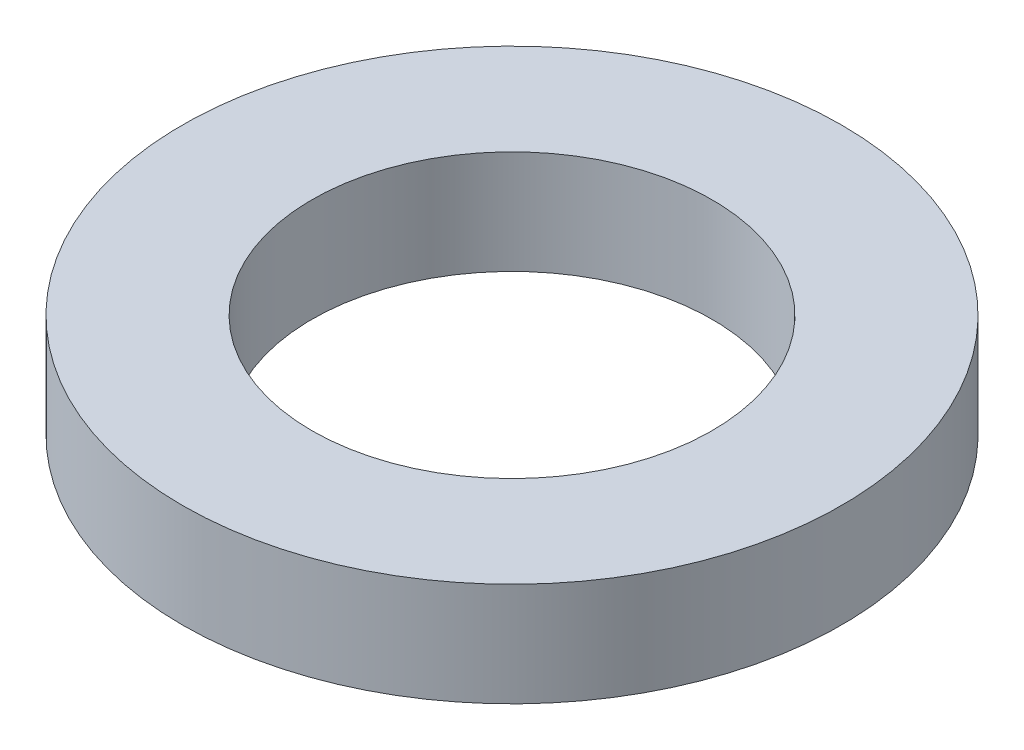
ISO-10303-21;
HEADER;
FILE_DESCRIPTION(('STEP AP214'),'2;1');
FILE_NAME('part.step','',(''),(''),'','','');
FILE_SCHEMA(('AUTOMOTIVE_DESIGN { 1 0 10303 214 1 1 1 1 }'));
ENDSEC;
DATA;
#1=APPLICATION_CONTEXT('core data for automotive mechanical design processes');
#2=APPLICATION_PROTOCOL_DEFINITION('international standard','automotive_design',2000,#1);
#3=PRODUCT_CONTEXT('',#1,'mechanical');
#4=PRODUCT('Part','Part','',(#3));
#5=PRODUCT_RELATED_PRODUCT_CATEGORY('part','',(#4));
#6=PRODUCT_DEFINITION_FORMATION('','',#4);
#7=PRODUCT_DEFINITION_CONTEXT('part definition',#1,'design');
#8=PRODUCT_DEFINITION('design','',#6,#7);
#9=PRODUCT_DEFINITION_SHAPE('','',#8);
#10=(LENGTH_UNIT() NAMED_UNIT(*) SI_UNIT(.MILLI.,.METRE.));
#11=(NAMED_UNIT(*) PLANE_ANGLE_UNIT() SI_UNIT($,.RADIAN.));
#12=(NAMED_UNIT(*) SI_UNIT($,.STERADIAN.) SOLID_ANGLE_UNIT());
#13=UNCERTAINTY_MEASURE_WITH_UNIT(LENGTH_MEASURE(1.E-05),#10,'distance_accuracy_value','');
#14=(GEOMETRIC_REPRESENTATION_CONTEXT(3) GLOBAL_UNCERTAINTY_ASSIGNED_CONTEXT((#13)) GLOBAL_UNIT_ASSIGNED_CONTEXT((#10,
#11,#12)) REPRESENTATION_CONTEXT('',''));
#15=CARTESIAN_POINT('',(0.,0.,0.));
#16=DIRECTION('',(0.,0.,1.));
#17=DIRECTION('',(1.,0.,0.));
#18=AXIS2_PLACEMENT_3D('',#15,#16,#17);
#19=CARTESIAN_POINT('',(0.,22.,0.));
#20=DIRECTION('',(0.,-1.,0.));
#21=DIRECTION('',(0.,0.,-1.));
#22=AXIS2_PLACEMENT_3D('',#19,#20,#21);
#23=CYLINDRICAL_SURFACE('',#22,70.);
#24=CARTESIAN_POINT('',(0.,22.,0.));
#25=DIRECTION('',(0.,1.,0.));
#26=DIRECTION('',(0.,0.,1.));
#27=AXIS2_PLACEMENT_3D('',#24,#25,#26);
#28=CIRCLE('',#27,70.);
#29=CARTESIAN_POINT('',(0.,22.,70.));
#30=VERTEX_POINT('',#29);
#31=EDGE_CURVE('E10',#30,#30,#28,.T.);
#32=ORIENTED_EDGE('',*,*,#31,.F.);
#33=EDGE_LOOP('',(#32));
#34=FACE_BOUND('',#33,.T.);
#35=CARTESIAN_POINT('',(0.,0.,0.));
#36=DIRECTION('',(0.,1.,0.));
#37=DIRECTION('',(0.,0.,1.));
#38=AXIS2_PLACEMENT_3D('',#35,#36,#37);
#39=CIRCLE('',#38,70.);
#40=CARTESIAN_POINT('',(0.,0.,70.));
#41=VERTEX_POINT('',#40);
#42=EDGE_CURVE('E37',#41,#41,#39,.T.);
#43=ORIENTED_EDGE('',*,*,#42,.T.);
#44=EDGE_LOOP('',(#43));
#45=FACE_BOUND('',#44,.T.);
#46=ADVANCED_FACE('F40',(#34,#45),#23,.T.);
#47=CARTESIAN_POINT('',(0.,22.,0.));
#48=DIRECTION('',(0.,1.,0.));
#49=DIRECTION('',(0.,0.,1.));
#50=AXIS2_PLACEMENT_3D('',#47,#48,#49);
#51=PLANE('',#50);
#52=CARTESIAN_POINT('',(0.,22.,0.));
#53=DIRECTION('',(0.,1.,0.));
#54=DIRECTION('',(0.,0.,1.));
#55=AXIS2_PLACEMENT_3D('',#52,#53,#54);
#56=CIRCLE('',#55,42.5);
#57=CARTESIAN_POINT('',(0.,22.,42.5));
#58=VERTEX_POINT('',#57);
#59=EDGE_CURVE('E50',#58,#58,#56,.T.);
#60=ORIENTED_EDGE('',*,*,#59,.F.);
#61=EDGE_LOOP('',(#60));
#62=FACE_BOUND('',#61,.T.);
#63=ORIENTED_EDGE('',*,*,#31,.T.);
#64=EDGE_LOOP('',(#63));
#65=FACE_BOUND('',#64,.T.);
#66=ADVANCED_FACE('F59',(#62,#65),#51,.T.);
#67=CARTESIAN_POINT('',(0.,0.,0.));
#68=DIRECTION('',(0.,1.,0.));
#69=DIRECTION('',(0.,0.,1.));
#70=AXIS2_PLACEMENT_3D('',#67,#68,#69);
#71=PLANE('',#70);
#72=CARTESIAN_POINT('',(0.,0.,0.));
#73=DIRECTION('',(0.,1.,0.));
#74=DIRECTION('',(0.,0.,1.));
#75=AXIS2_PLACEMENT_3D('',#72,#73,#74);
#76=CIRCLE('',#75,42.5);
#77=CARTESIAN_POINT('',(0.,0.,42.5));
#78=VERTEX_POINT('',#77);
#79=EDGE_CURVE('E47',#78,#78,#76,.T.);
#80=ORIENTED_EDGE('',*,*,#79,.T.);
#81=EDGE_LOOP('',(#80));
#82=FACE_BOUND('',#81,.T.);
#83=ORIENTED_EDGE('',*,*,#42,.F.);
#84=EDGE_LOOP('',(#83));
#85=FACE_BOUND('',#84,.T.);
#86=ADVANCED_FACE('F58',(#82,#85),#71,.F.);
#87=CARTESIAN_POINT('',(0.,22.,0.));
#88=DIRECTION('',(0.,-1.,0.));
#89=DIRECTION('',(0.,0.,-1.));
#90=AXIS2_PLACEMENT_3D('',#87,#88,#89);
#91=CYLINDRICAL_SURFACE('',#90,42.5);
#92=ORIENTED_EDGE('',*,*,#59,.T.);
#93=EDGE_LOOP('',(#92));
#94=FACE_BOUND('',#93,.T.);
#95=ORIENTED_EDGE('',*,*,#79,.F.);
#96=EDGE_LOOP('',(#95));
#97=FACE_BOUND('',#96,.T.);
#98=ADVANCED_FACE('F54',(#94,#97),#91,.F.);
#99=CLOSED_SHELL('',(#46,#66,#86,#98));
#100=MANIFOLD_SOLID_BREP('B2',#99);
#101=ADVANCED_BREP_SHAPE_REPRESENTATION('',(#18,#100),#14);
#102=SHAPE_DEFINITION_REPRESENTATION(#9,#101);
ENDSEC;
END-ISO-10303-21;
